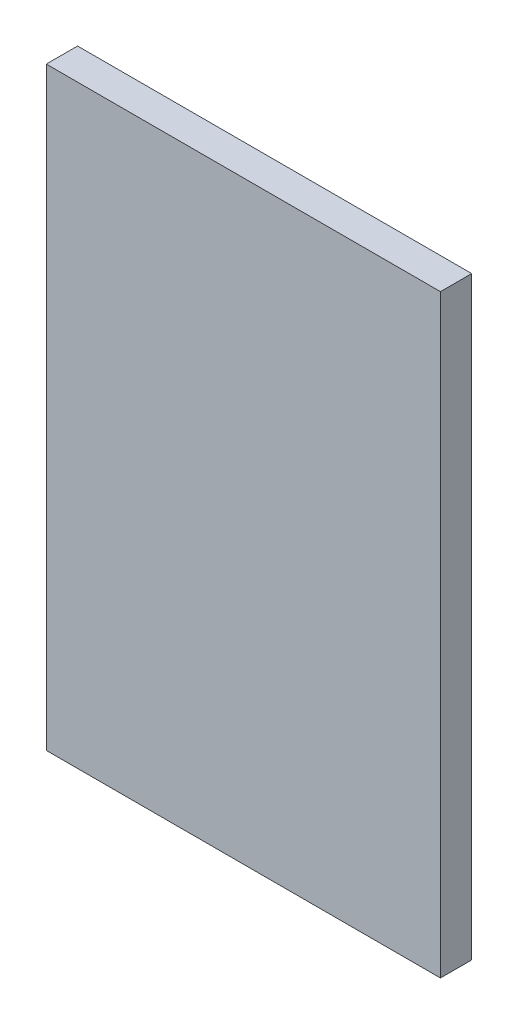
ISO-10303-21;
HEADER;
FILE_DESCRIPTION(('STEP AP214'),'2;1');
FILE_NAME('part.step','',(''),(''),'','','');
FILE_SCHEMA(('AUTOMOTIVE_DESIGN { 1 0 10303 214 1 1 1 1 }'));
ENDSEC;
DATA;
#1=APPLICATION_CONTEXT('core data for automotive mechanical design processes');
#2=APPLICATION_PROTOCOL_DEFINITION('international standard','automotive_design',2000,#1);
#3=PRODUCT_CONTEXT('',#1,'mechanical');
#4=PRODUCT('Part','Part','',(#3));
#5=PRODUCT_RELATED_PRODUCT_CATEGORY('part','',(#4));
#6=PRODUCT_DEFINITION_FORMATION('','',#4);
#7=PRODUCT_DEFINITION_CONTEXT('part definition',#1,'design');
#8=PRODUCT_DEFINITION('design','',#6,#7);
#9=PRODUCT_DEFINITION_SHAPE('','',#8);
#10=(LENGTH_UNIT() NAMED_UNIT(*) SI_UNIT(.MILLI.,.METRE.));
#11=(NAMED_UNIT(*) PLANE_ANGLE_UNIT() SI_UNIT($,.RADIAN.));
#12=(NAMED_UNIT(*) SI_UNIT($,.STERADIAN.) SOLID_ANGLE_UNIT());
#13=UNCERTAINTY_MEASURE_WITH_UNIT(LENGTH_MEASURE(1.E-05),#10,'distance_accuracy_value','');
#14=(GEOMETRIC_REPRESENTATION_CONTEXT(3) GLOBAL_UNCERTAINTY_ASSIGNED_CONTEXT((#13)) GLOBAL_UNIT_ASSIGNED_CONTEXT((#10,
#11,#12)) REPRESENTATION_CONTEXT('',''));
#15=CARTESIAN_POINT('',(0.,0.,0.));
#16=DIRECTION('',(0.,0.,1.));
#17=DIRECTION('',(1.,0.,0.));
#18=AXIS2_PLACEMENT_3D('',#15,#16,#17);
#19=CARTESIAN_POINT('',(8.001,-12.065,1.27));
#20=DIRECTION('',(-1.,0.,0.));
#21=DIRECTION('',(0.,0.,1.));
#22=AXIS2_PLACEMENT_3D('',#19,#20,#21);
#23=PLANE('',#22);
#24=DIRECTION('',(0.,1.,0.));
#25=VECTOR('',#24,1.);
#26=CARTESIAN_POINT('',(8.001,-12.065,0.));
#27=LINE('',#26,#25);
#28=CARTESIAN_POINT('',(8.001,-12.065,0.));
#29=VERTEX_POINT('',#28);
#30=CARTESIAN_POINT('',(8.001,12.065,0.));
#31=VERTEX_POINT('',#30);
#32=EDGE_CURVE('E109',#29,#31,#27,.T.);
#33=ORIENTED_EDGE('',*,*,#32,.T.);
#34=DIRECTION('',(0.,0.,-1.));
#35=VECTOR('',#34,1.);
#36=CARTESIAN_POINT('',(8.001,12.065,1.27));
#37=LINE('',#36,#35);
#38=CARTESIAN_POINT('',(8.001,12.065,1.27));
#39=VERTEX_POINT('',#38);
#40=EDGE_CURVE('E11',#39,#31,#37,.T.);
#41=ORIENTED_EDGE('',*,*,#40,.F.);
#42=DIRECTION('',(0.,1.,0.));
#43=VECTOR('',#42,1.);
#44=CARTESIAN_POINT('',(8.001,-12.065,1.27));
#45=LINE('',#44,#43);
#46=CARTESIAN_POINT('',(8.001,-12.065,1.27));
#47=VERTEX_POINT('',#46);
#48=EDGE_CURVE('E92',#47,#39,#45,.T.);
#49=ORIENTED_EDGE('',*,*,#48,.F.);
#50=DIRECTION('',(0.,0.,-1.));
#51=VECTOR('',#50,1.);
#52=CARTESIAN_POINT('',(8.001,-12.065,1.27));
#53=LINE('',#52,#51);
#54=EDGE_CURVE('E105',#47,#29,#53,.T.);
#55=ORIENTED_EDGE('',*,*,#54,.T.);
#56=EDGE_LOOP('',(#33,#41,#49,#55));
#57=FACE_BOUND('',#56,.T.);
#58=ADVANCED_FACE('F40',(#57),#23,.F.);
#59=CARTESIAN_POINT('',(-8.001,12.065,1.27));
#60=DIRECTION('',(0.,-1.,0.));
#61=DIRECTION('',(0.,0.,-1.));
#62=AXIS2_PLACEMENT_3D('',#59,#60,#61);
#63=PLANE('',#62);
#64=DIRECTION('',(-1.,0.,0.));
#65=VECTOR('',#64,1.);
#66=CARTESIAN_POINT('',(-8.001,12.065,0.));
#67=LINE('',#66,#65);
#68=CARTESIAN_POINT('',(-8.001,12.065,0.));
#69=VERTEX_POINT('',#68);
#70=EDGE_CURVE('E97',#31,#69,#67,.T.);
#71=ORIENTED_EDGE('',*,*,#70,.T.);
#72=DIRECTION('',(0.,0.,-1.));
#73=VECTOR('',#72,1.);
#74=CARTESIAN_POINT('',(-8.001,12.065,1.27));
#75=LINE('',#74,#73);
#76=CARTESIAN_POINT('',(-8.001,12.065,1.27));
#77=VERTEX_POINT('',#76);
#78=EDGE_CURVE('E49',#77,#69,#75,.T.);
#79=ORIENTED_EDGE('',*,*,#78,.F.);
#80=DIRECTION('',(-1.,0.,0.));
#81=VECTOR('',#80,1.);
#82=CARTESIAN_POINT('',(-8.001,12.065,1.27));
#83=LINE('',#82,#81);
#84=EDGE_CURVE('E87',#39,#77,#83,.T.);
#85=ORIENTED_EDGE('',*,*,#84,.F.);
#86=ORIENTED_EDGE('',*,*,#40,.T.);
#87=EDGE_LOOP('',(#71,#79,#85,#86));
#88=FACE_BOUND('',#87,.T.);
#89=ADVANCED_FACE('F96',(#88),#63,.F.);
#90=CARTESIAN_POINT('',(-8.001,-12.065,1.27));
#91=DIRECTION('',(1.,0.,0.));
#92=DIRECTION('',(0.,0.,-1.));
#93=AXIS2_PLACEMENT_3D('',#90,#91,#92);
#94=PLANE('',#93);
#95=DIRECTION('',(0.,-1.,0.));
#96=VECTOR('',#95,1.);
#97=CARTESIAN_POINT('',(-8.001,-12.065,0.));
#98=LINE('',#97,#96);
#99=CARTESIAN_POINT('',(-8.001,-12.065,0.));
#100=VERTEX_POINT('',#99);
#101=EDGE_CURVE('E74',#69,#100,#98,.T.);
#102=ORIENTED_EDGE('',*,*,#101,.T.);
#103=DIRECTION('',(0.,0.,-1.));
#104=VECTOR('',#103,1.);
#105=CARTESIAN_POINT('',(-8.001,-12.065,1.27));
#106=LINE('',#105,#104);
#107=CARTESIAN_POINT('',(-8.001,-12.065,1.27));
#108=VERTEX_POINT('',#107);
#109=EDGE_CURVE('E99',#108,#100,#106,.T.);
#110=ORIENTED_EDGE('',*,*,#109,.F.);
#111=DIRECTION('',(0.,-1.,0.));
#112=VECTOR('',#111,1.);
#113=CARTESIAN_POINT('',(-8.001,-12.065,1.27));
#114=LINE('',#113,#112);
#115=EDGE_CURVE('E90',#77,#108,#114,.T.);
#116=ORIENTED_EDGE('',*,*,#115,.F.);
#117=ORIENTED_EDGE('',*,*,#78,.T.);
#118=EDGE_LOOP('',(#102,#110,#116,#117));
#119=FACE_BOUND('',#118,.T.);
#120=ADVANCED_FACE('F100',(#119),#94,.F.);
#121=CARTESIAN_POINT('',(-8.001,-12.065,1.27));
#122=DIRECTION('',(0.,1.,0.));
#123=DIRECTION('',(0.,0.,1.));
#124=AXIS2_PLACEMENT_3D('',#121,#122,#123);
#125=PLANE('',#124);
#126=DIRECTION('',(1.,0.,0.));
#127=VECTOR('',#126,1.);
#128=CARTESIAN_POINT('',(-8.001,-12.065,0.));
#129=LINE('',#128,#127);
#130=EDGE_CURVE('E80',#100,#29,#129,.T.);
#131=ORIENTED_EDGE('',*,*,#130,.T.);
#132=ORIENTED_EDGE('',*,*,#54,.F.);
#133=DIRECTION('',(1.,0.,0.));
#134=VECTOR('',#133,1.);
#135=CARTESIAN_POINT('',(-8.001,-12.065,1.27));
#136=LINE('',#135,#134);
#137=EDGE_CURVE('E57',#108,#47,#136,.T.);
#138=ORIENTED_EDGE('',*,*,#137,.F.);
#139=ORIENTED_EDGE('',*,*,#109,.T.);
#140=EDGE_LOOP('',(#131,#132,#138,#139));
#141=FACE_BOUND('',#140,.T.);
#142=ADVANCED_FACE('F123',(#141),#125,.F.);
#143=CARTESIAN_POINT('',(0.,0.,1.27));
#144=DIRECTION('',(0.,0.,-1.));
#145=DIRECTION('',(-1.,0.,0.));
#146=AXIS2_PLACEMENT_3D('',#143,#144,#145);
#147=PLANE('',#146);
#148=ORIENTED_EDGE('',*,*,#48,.T.);
#149=ORIENTED_EDGE('',*,*,#84,.T.);
#150=ORIENTED_EDGE('',*,*,#115,.T.);
#151=ORIENTED_EDGE('',*,*,#137,.T.);
#152=EDGE_LOOP('',(#148,#149,#150,#151));
#153=FACE_BOUND('',#152,.T.);
#154=ADVANCED_FACE('F88',(#153),#147,.F.);
#155=CARTESIAN_POINT('',(0.,0.,0.));
#156=DIRECTION('',(0.,0.,-1.));
#157=DIRECTION('',(-1.,0.,0.));
#158=AXIS2_PLACEMENT_3D('',#155,#156,#157);
#159=PLANE('',#158);
#160=ORIENTED_EDGE('',*,*,#32,.F.);
#161=ORIENTED_EDGE('',*,*,#130,.F.);
#162=ORIENTED_EDGE('',*,*,#101,.F.);
#163=ORIENTED_EDGE('',*,*,#70,.F.);
#164=EDGE_LOOP('',(#160,#161,#162,#163));
#165=FACE_BOUND('',#164,.T.);
#166=ADVANCED_FACE('F126',(#165),#159,.T.);
#167=CLOSED_SHELL('',(#58,#89,#120,#142,#154,#166));
#168=MANIFOLD_SOLID_BREP('B2',#167);
#169=ADVANCED_BREP_SHAPE_REPRESENTATION('',(#18,#168),#14);
#170=SHAPE_DEFINITION_REPRESENTATION(#9,#169);
ENDSEC;
END-ISO-10303-21;
